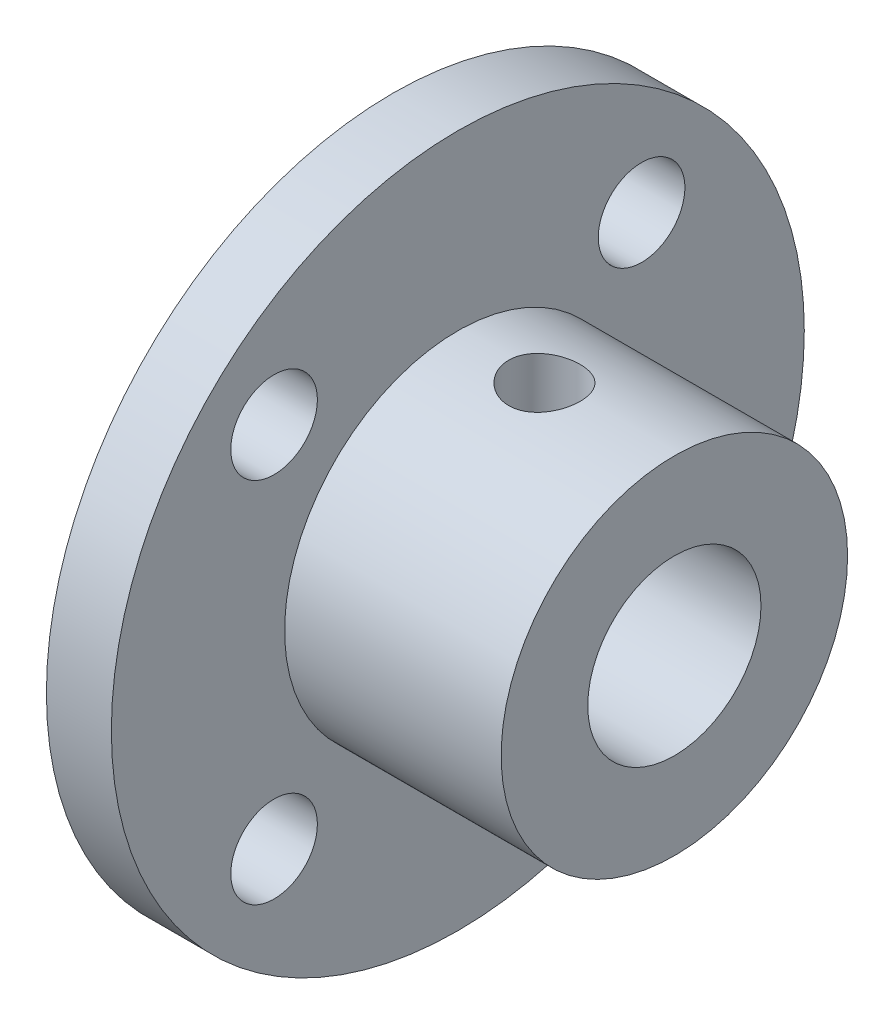
ISO-10303-21;
HEADER;
FILE_DESCRIPTION(('STEP AP214'),'2;1');
FILE_NAME('part.step','',(''),(''),'','','');
FILE_SCHEMA(('AUTOMOTIVE_DESIGN { 1 0 10303 214 1 1 1 1 }'));
ENDSEC;
DATA;
#1=APPLICATION_CONTEXT('core data for automotive mechanical design processes');
#2=APPLICATION_PROTOCOL_DEFINITION('international standard','automotive_design',2000,#1);
#3=PRODUCT_CONTEXT('',#1,'mechanical');
#4=PRODUCT('Part','Part','',(#3));
#5=PRODUCT_RELATED_PRODUCT_CATEGORY('part','',(#4));
#6=PRODUCT_DEFINITION_FORMATION('','',#4);
#7=PRODUCT_DEFINITION_CONTEXT('part definition',#1,'design');
#8=PRODUCT_DEFINITION('design','',#6,#7);
#9=PRODUCT_DEFINITION_SHAPE('','',#8);
#10=(LENGTH_UNIT() NAMED_UNIT(*) SI_UNIT(.MILLI.,.METRE.));
#11=(NAMED_UNIT(*) PLANE_ANGLE_UNIT() SI_UNIT($,.RADIAN.));
#12=(NAMED_UNIT(*) SI_UNIT($,.STERADIAN.) SOLID_ANGLE_UNIT());
#13=UNCERTAINTY_MEASURE_WITH_UNIT(LENGTH_MEASURE(1.E-05),#10,'distance_accuracy_value','');
#14=(GEOMETRIC_REPRESENTATION_CONTEXT(3) GLOBAL_UNCERTAINTY_ASSIGNED_CONTEXT((#13)) GLOBAL_UNIT_ASSIGNED_CONTEXT((#10,
#11,#12)) REPRESENTATION_CONTEXT('',''));
#15=CARTESIAN_POINT('',(0.,0.,0.));
#16=DIRECTION('',(0.,0.,1.));
#17=DIRECTION('',(1.,0.,0.));
#18=AXIS2_PLACEMENT_3D('',#15,#16,#17);
#19=CARTESIAN_POINT('',(10.,0.,0.));
#20=DIRECTION('',(1.,0.,0.));
#21=DIRECTION('',(0.,0.,-1.));
#22=AXIS2_PLACEMENT_3D('',#19,#20,#21);
#23=PLANE('',#22);
#24=CARTESIAN_POINT('',(10.,0.,0.));
#25=DIRECTION('',(1.,0.,0.));
#26=DIRECTION('',(0.,0.,-1.));
#27=AXIS2_PLACEMENT_3D('',#24,#25,#26);
#28=CIRCLE('',#27,8.);
#29=CARTESIAN_POINT('',(10.,0.,-8.));
#30=VERTEX_POINT('',#29);
#31=EDGE_CURVE('E10',#30,#30,#28,.T.);
#32=ORIENTED_EDGE('',*,*,#31,.T.);
#33=EDGE_LOOP('',(#32));
#34=FACE_BOUND('',#33,.T.);
#35=CARTESIAN_POINT('',(10.,0.,0.));
#36=DIRECTION('',(1.,0.,0.));
#37=DIRECTION('',(0.,0.,-1.));
#38=AXIS2_PLACEMENT_3D('',#35,#36,#37);
#39=CIRCLE('',#38,4.);
#40=CARTESIAN_POINT('',(10.,0.,-4.));
#41=VERTEX_POINT('',#40);
#42=EDGE_CURVE('E52',#41,#41,#39,.T.);
#43=ORIENTED_EDGE('',*,*,#42,.F.);
#44=EDGE_LOOP('',(#43));
#45=FACE_BOUND('',#44,.T.);
#46=ADVANCED_FACE('F38',(#34,#45),#23,.T.);
#47=CARTESIAN_POINT('',(10.,0.,0.));
#48=DIRECTION('',(-1.,0.,0.));
#49=DIRECTION('',(0.,0.,1.));
#50=AXIS2_PLACEMENT_3D('',#47,#48,#49);
#51=CYLINDRICAL_SURFACE('',#50,8.);
#52=CARTESIAN_POINT('',(4.00035076654487,7.82799463464303,-1.65));
#53=CARTESIAN_POINT('',(4.091968116339,7.82799647234761,-1.64999668532493));
#54=CARTESIAN_POINT('',(4.18362658129771,7.82962054015776,-1.64234339972764));
#55=CARTESIAN_POINT('',(4.36434613563069,7.83593102109728,-1.61196056082935));
#56=CARTESIAN_POINT('',(4.45340515599138,7.84061980768031,-1.58921932254548));
#57=CARTESIAN_POINT('',(4.62628525874949,7.85250661788931,-1.52939944297714));
#58=CARTESIAN_POINT('',(4.71011162215764,7.85970206178507,-1.49233553761892));
#59=CARTESIAN_POINT('',(4.87035536880974,7.8757883628587,-1.40496339378157));
#60=CARTESIAN_POINT('',(4.94677308012042,7.88467914491256,-1.35465574212316));
#61=CARTESIAN_POINT('',(5.09118206969048,7.90330366333984,-1.24141806188276));
#62=CARTESIAN_POINT('',(5.15904576782534,7.91304715328143,-1.17832691131059));
#63=CARTESIAN_POINT('',(5.28330538030519,7.93219354684102,-1.04166118718968));
#64=CARTESIAN_POINT('',(5.33970046312054,7.9415964257225,-0.968085854144705));
#65=CARTESIAN_POINT('',(5.43992019290314,7.95910768239297,-0.811692001393459));
#66=CARTESIAN_POINT('',(5.48362312036294,7.9672032148807,-0.728793920101068));
#67=CARTESIAN_POINT('',(5.5564318759791,7.98107786735649,-0.556636173632882));
#68=CARTESIAN_POINT('',(5.58553915812495,7.9868572180665,-0.467377143134519));
#69=CARTESIAN_POINT('',(5.62793187904984,7.99537941797959,-0.286356118265322));
#70=CARTESIAN_POINT('',(5.64143291864162,7.99816360714569,-0.194646593521391));
#71=CARTESIAN_POINT('',(5.6529030379666,8.00052470522147,-0.0102247919218274));
#72=CARTESIAN_POINT('',(5.65087370531701,8.00010194196704,0.0824873814688672));
#73=CARTESIAN_POINT('',(5.63150325464077,7.9961286601365,0.264799667160884));
#74=CARTESIAN_POINT('',(5.6143944216658,7.99262559257093,0.35442564460906));
#75=CARTESIAN_POINT('',(5.56571962012067,7.98293899531616,0.529506535845924));
#76=CARTESIAN_POINT('',(5.53415304765959,7.97675535366161,0.614961275239551));
#77=CARTESIAN_POINT('',(5.45724680685401,7.96232481023259,0.779930808135334));
#78=CARTESIAN_POINT('',(5.41181709665387,7.95406448397429,0.8594024031912));
#79=CARTESIAN_POINT('',(5.30854095248704,7.93638961806161,1.00967984091355));
#80=CARTESIAN_POINT('',(5.25069300384532,7.92697493766869,1.08048462481769));
#81=CARTESIAN_POINT('',(5.12295127384974,7.9078239642189,1.21279807501825));
#82=CARTESIAN_POINT('',(5.05285419053476,7.89808494418976,1.27411022634264));
#83=CARTESIAN_POINT('',(4.90327372128579,7.87954771497238,1.38414252261934));
#84=CARTESIAN_POINT('',(4.82379013459255,7.87074952591437,1.43286239817598));
#85=CARTESIAN_POINT('',(4.65739922122191,7.85508413098618,1.51640121308694));
#86=CARTESIAN_POINT('',(4.57047459099182,7.84822159457677,1.55118662114807));
#87=CARTESIAN_POINT('',(4.391839658319,7.83727167258975,1.60559987539904));
#88=CARTESIAN_POINT('',(4.30013002487229,7.83318390018328,1.62522983445703));
#89=CARTESIAN_POINT('',(4.11631420201765,7.82832430034404,1.64847767759947));
#90=CARTESIAN_POINT('',(4.02424551739551,7.82749355348184,1.65238010858406));
#91=CARTESIAN_POINT('',(3.84077289285087,7.8290836566982,1.64482933127386));
#92=CARTESIAN_POINT('',(3.74936891301321,7.83150430988348,1.63337705280605));
#93=CARTESIAN_POINT('',(3.57078784083855,7.83926913983493,1.59568777426686));
#94=CARTESIAN_POINT('',(3.48357690023534,7.84458293687796,1.56960432546509));
#95=CARTESIAN_POINT('',(3.31476300328205,7.85750843647708,1.50355797289373));
#96=CARTESIAN_POINT('',(3.23316053438895,7.8651203384623,1.46359386451765));
#97=CARTESIAN_POINT('',(3.07663931470259,7.88191579950281,1.37028211396986));
#98=CARTESIAN_POINT('',(3.0018283910492,7.89111960565472,1.31675731908659));
#99=CARTESIAN_POINT('',(2.86214624274356,7.91000699478186,1.19807829347333));
#100=CARTESIAN_POINT('',(2.79727611074392,7.91969063034348,1.13292278604281));
#101=CARTESIAN_POINT('',(2.67822982885061,7.93863877717957,0.991551131023633));
#102=CARTESIAN_POINT('',(2.62424659668679,7.94789380519354,0.915171051258591));
#103=CARTESIAN_POINT('',(2.52987848376741,7.96477402593325,0.75426073813027));
#104=CARTESIAN_POINT('',(2.48949300944358,7.97239928979603,0.669730860728582));
#105=CARTESIAN_POINT('',(2.42374396062643,7.98512048804082,0.495414150876537));
#106=CARTESIAN_POINT('',(2.39829173577687,7.99023131933467,0.405661891513272));
#107=CARTESIAN_POINT('',(2.36285201406678,7.99741186635557,0.223039444294588));
#108=CARTESIAN_POINT('',(2.35286253037978,7.99948197278732,0.130169658580923));
#109=CARTESIAN_POINT('',(2.34871283878849,8.00033781964049,-0.0542126492055723));
#110=CARTESIAN_POINT('',(2.35426325406208,7.99918360281958,-0.145718502140297));
#111=CARTESIAN_POINT('',(2.38039416163531,7.99384751004402,-0.326463478938165));
#112=CARTESIAN_POINT('',(2.40097443977329,7.98966567723011,-0.415702635080896));
#113=CARTESIAN_POINT('',(2.45644890770306,7.97874682116246,-0.589186560182794));
#114=CARTESIAN_POINT('',(2.49130627753187,7.97201637401338,-0.673443542985805));
#115=CARTESIAN_POINT('',(2.57430780865125,7.95672300876336,-0.83495351327695));
#116=CARTESIAN_POINT('',(2.62245310011739,7.9481599348062,-0.912205904261777));
#117=CARTESIAN_POINT('',(2.73162941183047,7.92995681960445,-1.05893847166514));
#118=CARTESIAN_POINT('',(2.7928663362949,7.92030089151862,-1.12826349060999));
#119=CARTESIAN_POINT('',(2.92606700819132,7.90109178015231,-1.25575285452553));
#120=CARTESIAN_POINT('',(2.99803330509024,7.89153862187156,-1.31391453937944));
#121=CARTESIAN_POINT('',(3.15165187037277,7.87349423401939,-1.41807001635073));
#122=CARTESIAN_POINT('',(3.23340676885327,7.86501660134749,-1.46391490783104));
#123=CARTESIAN_POINT('',(3.40361365271401,7.85025069483304,-1.54114313624576));
#124=CARTESIAN_POINT('',(3.49205961211167,7.84396047891661,-1.5725393093673));
#125=CARTESIAN_POINT('',(3.65061799084718,7.83550744278865,-1.61404620798977));
#126=CARTESIAN_POINT('',(3.7198397149459,7.83270799535493,-1.62750420424828));
#127=CARTESIAN_POINT('',(3.85948314308952,7.82895092043294,-1.64548220150439));
#128=CARTESIAN_POINT('',(3.92990480054815,7.82799322160417,-1.65000254870379));
#129=CARTESIAN_POINT('',(4.00035076654487,7.82799463464303,-1.65));
#130=B_SPLINE_CURVE_WITH_KNOTS('',3,(#52,#53,#54,#55,#56,#57,#58,#59,#60,#61,#62,#63,#64,#65,
#66,#67,#68,#69,#70,#71,#72,#73,#74,#75,#76,#77,#78,#79,#80,#81,#82,#83,#84,#85,#86,#87,#88,#89,
#90,#91,#92,#93,#94,#95,#96,#97,#98,#99,#100,#101,#102,#103,#104,#105,#106,#107,#108,#109,#110,
#111,#112,#113,#114,#115,#116,#117,#118,#119,#120,#121,#122,#123,#124,#125,#126,#127,#128,#129),
.UNSPECIFIED.,.T.,.F.,(4,2,2,2,2,2,2,2,2,2,2,2,2,2,2,2,2,2,2,2,2,2,2,2,2,2,2,2,2,2,2,2,2,2,2,2,
2,2,4),(0.,0.274594036981749,0.549400984088786,0.823925944657622,1.09843874327276,
1.3766547467594,1.65489091505464,1.93571338943598,2.21650788327397,2.49337499570618,
2.7702138053317,3.04286128513494,3.31552015429504,3.58998907522696,3.86449149267073,
4.14407920367274,4.42367289560191,4.70393540521658,4.98415883550651,5.25928898855094,
5.53440248143717,5.80668132243982,6.07898379854719,6.3550456167432,6.63113775683412,
6.91175972338567,7.19236943866021,7.47129602001296,7.75018675877317,8.02391884651824,
8.29764703391015,8.57067368982021,8.8437235745846,9.12143378060413,9.3992100804003,
9.68020708192082,9.96095396255221,10.1721016499172,10.38324115827),.UNSPECIFIED.);
#131=CARTESIAN_POINT('',(4.00035076654487,7.82799463464303,-1.65));
#132=VERTEX_POINT('',#131);
#133=EDGE_CURVE('E96',#132,#132,#130,.T.);
#134=ORIENTED_EDGE('',*,*,#133,.T.);
#135=EDGE_LOOP('',(#134));
#136=FACE_BOUND('',#135,.T.);
#137=ORIENTED_EDGE('',*,*,#31,.F.);
#138=EDGE_LOOP('',(#137));
#139=FACE_BOUND('',#138,.T.);
#140=CARTESIAN_POINT('',(0.,0.,0.));
#141=DIRECTION('',(1.,0.,0.));
#142=DIRECTION('',(0.,0.,-1.));
#143=AXIS2_PLACEMENT_3D('',#140,#141,#142);
#144=CIRCLE('',#143,8.);
#145=CARTESIAN_POINT('',(0.,0.,-8.));
#146=VERTEX_POINT('',#145);
#147=EDGE_CURVE('E57',#146,#146,#144,.T.);
#148=ORIENTED_EDGE('',*,*,#147,.T.);
#149=EDGE_LOOP('',(#148));
#150=FACE_BOUND('',#149,.T.);
#151=ADVANCED_FACE('F40',(#136,#139,#150),#51,.T.);
#152=CARTESIAN_POINT('',(10.,0.,0.));
#153=DIRECTION('',(-1.,0.,0.));
#154=DIRECTION('',(0.,0.,1.));
#155=AXIS2_PLACEMENT_3D('',#152,#153,#154);
#156=CYLINDRICAL_SURFACE('',#155,4.);
#157=CARTESIAN_POINT('',(4.00035076654487,3.64383040220041,-1.65));
#158=CARTESIAN_POINT('',(4.08844724677055,3.64383945275153,-1.64999056813102));
#159=CARTESIAN_POINT('',(4.17669119851846,3.64707173267573,-1.64289989177358));
#160=CARTESIAN_POINT('',(4.35063782762375,3.65959209124688,-1.61480845546373));
#161=CARTESIAN_POINT('',(4.43633286714247,3.66889676295874,-1.5937695789634));
#162=CARTESIAN_POINT('',(4.6023537046755,3.69231325052126,-1.53873536249638));
#163=CARTESIAN_POINT('',(4.68269958676346,3.70640571161012,-1.50479212400174));
#164=CARTESIAN_POINT('',(4.83653253337909,3.73778230052357,-1.42506535594206));
#165=CARTESIAN_POINT('',(4.9100213093289,3.75506562873473,-1.37928479159595));
#166=CARTESIAN_POINT('',(5.05257945439137,3.7920553041855,-1.27419856290371));
#167=CARTESIAN_POINT('',(5.12118002232507,3.81184277704779,-1.2142851824136));
#168=CARTESIAN_POINT('',(5.24770553845363,3.85094363418238,-1.08391072165483));
#169=CARTESIAN_POINT('',(5.30562641801709,3.87025683535296,-1.01344563996364));
#170=CARTESIAN_POINT('',(5.41152213784673,3.90721575035942,-0.860301943593381));
#171=CARTESIAN_POINT('',(5.45897169925103,3.92475616703248,-0.77723239011359));
#172=CARTESIAN_POINT('',(5.53902091186657,3.95520283117798,-0.603436361875856));
#173=CARTESIAN_POINT('',(5.57162703089143,3.96811109652272,-0.512713242513044));
#174=CARTESIAN_POINT('',(5.61937147320109,3.98726403378776,-0.331105172304397));
#175=CARTESIAN_POINT('',(5.6353176144681,3.99381564337609,-0.240465625184492));
#176=CARTESIAN_POINT('',(5.65189741840004,4.0006306156112,-0.0575763551498648));
#177=CARTESIAN_POINT('',(5.65253716186688,4.00089647540932,0.0346727137709554));
#178=CARTESIAN_POINT('',(5.63891427040827,3.99529224160632,0.212297380895985));
#179=CARTESIAN_POINT('',(5.62553858282777,3.98978733384658,0.297754665400397));
#180=CARTESIAN_POINT('',(5.58578194909711,3.97375926025944,0.465085845235279));
#181=CARTESIAN_POINT('',(5.55940004525419,3.96323572489496,0.546959476205492));
#182=CARTESIAN_POINT('',(5.49406310482469,3.93798907731603,0.706295606817229));
#183=CARTESIAN_POINT('',(5.45492277662,3.92320447216362,0.78367197976247));
#184=CARTESIAN_POINT('',(5.36535948735826,3.89088763760773,0.930960489992467));
#185=CARTESIAN_POINT('',(5.31493256604156,3.87335444442336,1.00086999453932));
#186=CARTESIAN_POINT('',(5.20016252751623,3.83587133640027,1.13638530947041));
#187=CARTESIAN_POINT('',(5.13509735564614,3.8158381454309,1.20135746318645));
#188=CARTESIAN_POINT('',(4.99494110022329,3.77653142784555,1.31973838423493));
#189=CARTESIAN_POINT('',(4.91984631728157,3.75725818494773,1.37314286572202));
#190=CARTESIAN_POINT('',(4.75875236299755,3.72106607156909,1.46845339844828));
#191=CARTESIAN_POINT('',(4.67248319485222,3.70424107982558,1.50994179309277));
#192=CARTESIAN_POINT('',(4.49330409513897,3.67596385006485,1.57754508127095));
#193=CARTESIAN_POINT('',(4.40039885267105,3.66450786071418,1.60367071206121));
#194=CARTESIAN_POINT('',(4.21692787135988,3.64919091711418,1.63821320355941));
#195=CARTESIAN_POINT('',(4.12659246536201,3.64489111171831,1.64765569454682));
#196=CARTESIAN_POINT('',(3.94554513684627,3.64311980380967,1.65157101672826));
#197=CARTESIAN_POINT('',(3.85483335048559,3.64564601607449,1.64604885780402));
#198=CARTESIAN_POINT('',(3.6815497574954,3.65678944366161,1.62112710501826));
#199=CARTESIAN_POINT('',(3.59882258687026,3.66501803861665,1.60261202118543));
#200=CARTESIAN_POINT('',(3.4377137021649,3.68614612916707,1.55339580262015));
#201=CARTESIAN_POINT('',(3.35933299519321,3.69904670212356,1.52269185697123));
#202=CARTESIAN_POINT('',(3.20547176084923,3.72872477858182,1.44853902204985));
#203=CARTESIAN_POINT('',(3.13025057176562,3.74564214050945,1.40460979308264));
#204=CARTESIAN_POINT('',(2.98789059711513,3.78124523189864,1.30573455409451));
#205=CARTESIAN_POINT('',(2.92075527880975,3.79993171387674,1.25078384473683));
#206=CARTESIAN_POINT('',(2.79092114009815,3.83876011670653,1.12627542162098));
#207=CARTESIAN_POINT('',(2.72899902949615,3.85889967217623,1.05590387126704));
#208=CARTESIAN_POINT('',(2.6177079108828,3.89698114804694,0.905297980080102));
#209=CARTESIAN_POINT('',(2.56833971454167,3.91492292631236,0.825063002026903));
#210=CARTESIAN_POINT('',(2.48364663233808,3.94668767391886,0.656516816883267));
#211=CARTESIAN_POINT('',(2.44834729154214,3.96050313975064,0.568191273870491));
#212=CARTESIAN_POINT('',(2.39335910968612,3.98237104121022,0.386140833605177));
#213=CARTESIAN_POINT('',(2.37366118360593,3.9904268305481,0.29241911281756));
#214=CARTESIAN_POINT('',(2.35156253762439,3.9994889299446,0.109187189544836));
#215=CARTESIAN_POINT('',(2.34806593780293,4.00094173424749,0.0198303081186357));
#216=CARTESIAN_POINT('',(2.35553620091515,3.99786220239438,-0.158161739195411));
#217=CARTESIAN_POINT('',(2.36650061654032,3.99333087896147,-0.246797024648479));
#218=CARTESIAN_POINT('',(2.40179540868043,3.979024148364,-0.417705375935876));
#219=CARTESIAN_POINT('',(2.42565520865942,3.96943363922013,-0.500092371627851));
#220=CARTESIAN_POINT('',(2.48555488142486,3.94605480923816,-0.659667355734159));
#221=CARTESIAN_POINT('',(2.52159709133155,3.93226568297163,-0.736854343148743));
#222=CARTESIAN_POINT('',(2.60665529323126,3.90105808483759,-0.887661133732618));
#223=CARTESIAN_POINT('',(2.6561820233178,3.88350423911689,-0.960964214361148));
#224=CARTESIAN_POINT('',(2.76605361333487,3.84685709666619,-1.09852932170704));
#225=CARTESIAN_POINT('',(2.82640238962568,3.82776324400832,-1.1627880603165));
#226=CARTESIAN_POINT('',(2.96093829389953,3.78859741195738,-1.28487769945047));
#227=CARTESIAN_POINT('',(3.03577852342981,3.76854475207571,-1.34199767947157));
#228=CARTESIAN_POINT('',(3.19461674222593,3.73105419200534,-1.4429647467733));
#229=CARTESIAN_POINT('',(3.27861975825446,3.7136177396712,-1.48680449811903));
#230=CARTESIAN_POINT('',(3.45307920781476,3.68370387904713,-1.55944447766651));
#231=CARTESIAN_POINT('',(3.54348987463596,3.67119480418034,-1.58834112875234));
#232=CARTESIAN_POINT('',(3.72839791062323,3.65281837075147,-1.63017263567573));
#233=CARTESIAN_POINT('',(3.82288045742174,3.64692873900432,-1.64316103312974));
#234=CARTESIAN_POINT('',(3.94521408018751,3.64414054419779,-1.6493120932942));
#235=CARTESIAN_POINT('',(3.97277519882989,3.64382756923723,-1.6500029523216));
#236=CARTESIAN_POINT('',(4.00035076654487,3.64383040220041,-1.65));
#237=B_SPLINE_CURVE_WITH_KNOTS('',3,(#157,#158,#159,#160,#161,#162,#163,#164,#165,#166,#167,
#168,#169,#170,#171,#172,#173,#174,#175,#176,#177,#178,#179,#180,#181,#182,#183,#184,#185,#186,
#187,#188,#189,#190,#191,#192,#193,#194,#195,#196,#197,#198,#199,#200,#201,#202,#203,#204,#205,
#206,#207,#208,#209,#210,#211,#212,#213,#214,#215,#216,#217,#218,#219,#220,#221,#222,#223,#224,
#225,#226,#227,#228,#229,#230,#231,#232,#233,#234,#235,#236),.UNSPECIFIED.,.T.,.F.,(4,2,2,2,2,2,
2,2,2,2,2,2,2,2,2,2,2,2,2,2,2,2,2,2,2,2,2,2,2,2,2,2,2,2,2,2,2,2,2,4),(0.,0.264211724660745,
0.529148459018597,0.793026677872048,1.05683885985756,1.33523297260792,1.61373292676209,
1.90403076094908,2.19420198072699,2.46953816244269,2.74476495901023,3.00356896819765,
3.26239203686791,3.52515526924739,3.78801084539545,4.06907613148064,4.35024537535724,
4.64031806272423,4.9301877724111,5.20152035698263,5.47276211576042,5.72713321026165,
5.9815630002888,6.24665916965708,6.51186861189123,6.79815687284346,7.08446363898862,
7.3712879145617,7.6579450434915,7.92489841526078,8.19180661499934,8.44957452423758,
8.70739191275387,8.97680852354694,9.24632283025306,9.53374725602174,9.82133016535515,
10.1070334851925,10.3917725616094,10.4744749384331),.UNSPECIFIED.);
#238=CARTESIAN_POINT('',(4.00035076654487,3.64383040220041,-1.65));
#239=VERTEX_POINT('',#238);
#240=EDGE_CURVE('E43',#239,#239,#237,.T.);
#241=ORIENTED_EDGE('',*,*,#240,.F.);
#242=EDGE_LOOP('',(#241));
#243=FACE_BOUND('',#242,.T.);
#244=ORIENTED_EDGE('',*,*,#42,.T.);
#245=EDGE_LOOP('',(#244));
#246=FACE_BOUND('',#245,.T.);
#247=CARTESIAN_POINT('',(-3.,0.,0.));
#248=DIRECTION('',(-1.,0.,0.));
#249=DIRECTION('',(0.,0.,1.));
#250=AXIS2_PLACEMENT_3D('',#247,#248,#249);
#251=CIRCLE('',#250,4.);
#252=CARTESIAN_POINT('',(-3.,0.,4.));
#253=VERTEX_POINT('',#252);
#254=EDGE_CURVE('E70',#253,#253,#251,.T.);
#255=ORIENTED_EDGE('',*,*,#254,.T.);
#256=EDGE_LOOP('',(#255));
#257=FACE_BOUND('',#256,.T.);
#258=ADVANCED_FACE('F130',(#243,#246,#257),#156,.F.);
#259=CARTESIAN_POINT('',(-3.,0.,0.));
#260=DIRECTION('',(-1.,0.,0.));
#261=DIRECTION('',(0.,0.,1.));
#262=AXIS2_PLACEMENT_3D('',#259,#260,#261);
#263=PLANE('',#262);
#264=CARTESIAN_POINT('',(-3.,-8.48528137423853,-8.48528137423862));
#265=DIRECTION('',(-1.,0.,0.));
#266=DIRECTION('',(0.,0.,1.));
#267=AXIS2_PLACEMENT_3D('',#264,#265,#266);
#268=CIRCLE('',#267,2.);
#269=CARTESIAN_POINT('',(-3.,-8.48528137423853,-6.48528137423862));
#270=VERTEX_POINT('',#269);
#271=EDGE_CURVE('E88',#270,#270,#268,.F.);
#272=ORIENTED_EDGE('',*,*,#271,.T.);
#273=EDGE_LOOP('',(#272));
#274=FACE_BOUND('',#273,.T.);
#275=CARTESIAN_POINT('',(-3.,8.48528137423858,8.48528137423856));
#276=DIRECTION('',(-1.,0.,0.));
#277=DIRECTION('',(0.,0.,1.));
#278=AXIS2_PLACEMENT_3D('',#275,#276,#277);
#279=CIRCLE('',#278,2.);
#280=CARTESIAN_POINT('',(-3.,8.48528137423858,10.4852813742386));
#281=VERTEX_POINT('',#280);
#282=EDGE_CURVE('E81',#281,#281,#279,.F.);
#283=ORIENTED_EDGE('',*,*,#282,.T.);
#284=EDGE_LOOP('',(#283));
#285=FACE_BOUND('',#284,.T.);
#286=CARTESIAN_POINT('',(-3.,8.48528137423853,-8.48528137423862));
#287=DIRECTION('',(-1.,0.,0.));
#288=DIRECTION('',(0.,0.,1.));
#289=AXIS2_PLACEMENT_3D('',#286,#287,#288);
#290=CIRCLE('',#289,2.);
#291=CARTESIAN_POINT('',(-3.,8.48528137423853,-6.48528137423862));
#292=VERTEX_POINT('',#291);
#293=EDGE_CURVE('E93',#292,#292,#290,.F.);
#294=ORIENTED_EDGE('',*,*,#293,.T.);
#295=EDGE_LOOP('',(#294));
#296=FACE_BOUND('',#295,.T.);
#297=CARTESIAN_POINT('',(-3.,-8.4852813742386,8.48528137423854));
#298=DIRECTION('',(-1.,0.,0.));
#299=DIRECTION('',(0.,0.,1.));
#300=AXIS2_PLACEMENT_3D('',#297,#298,#299);
#301=CIRCLE('',#300,2.);
#302=CARTESIAN_POINT('',(-3.,-8.4852813742386,10.4852813742385));
#303=VERTEX_POINT('',#302);
#304=EDGE_CURVE('E75',#303,#303,#301,.F.);
#305=ORIENTED_EDGE('',*,*,#304,.T.);
#306=EDGE_LOOP('',(#305));
#307=FACE_BOUND('',#306,.T.);
#308=CARTESIAN_POINT('',(-3.,0.,0.));
#309=DIRECTION('',(-1.,0.,0.));
#310=DIRECTION('',(0.,0.,1.));
#311=AXIS2_PLACEMENT_3D('',#308,#309,#310);
#312=CIRCLE('',#311,16.);
#313=CARTESIAN_POINT('',(-3.,0.,16.));
#314=VERTEX_POINT('',#313);
#315=EDGE_CURVE('E61',#314,#314,#312,.T.);
#316=ORIENTED_EDGE('',*,*,#315,.T.);
#317=EDGE_LOOP('',(#316));
#318=FACE_BOUND('',#317,.T.);
#319=ORIENTED_EDGE('',*,*,#254,.F.);
#320=EDGE_LOOP('',(#319));
#321=FACE_BOUND('',#320,.T.);
#322=ADVANCED_FACE('F126',(#274,#285,#296,#307,#318,#321),#263,.T.);
#323=CARTESIAN_POINT('',(0.,0.,0.));
#324=DIRECTION('',(-1.,0.,0.));
#325=DIRECTION('',(0.,0.,1.));
#326=AXIS2_PLACEMENT_3D('',#323,#324,#325);
#327=PLANE('',#326);
#328=CARTESIAN_POINT('',(0.,-8.48528137423853,-8.48528137423862));
#329=DIRECTION('',(1.,0.,0.));
#330=DIRECTION('',(0.,0.,1.));
#331=AXIS2_PLACEMENT_3D('',#328,#329,#330);
#332=CIRCLE('',#331,2.);
#333=CARTESIAN_POINT('',(0.,-8.48528137423853,-6.48528137423862));
#334=VERTEX_POINT('',#333);
#335=EDGE_CURVE('E78',#334,#334,#332,.T.);
#336=ORIENTED_EDGE('',*,*,#335,.F.);
#337=EDGE_LOOP('',(#336));
#338=FACE_BOUND('',#337,.T.);
#339=CARTESIAN_POINT('',(0.,8.48528137423858,8.48528137423856));
#340=DIRECTION('',(1.,0.,0.));
#341=DIRECTION('',(0.,0.,-1.));
#342=AXIS2_PLACEMENT_3D('',#339,#340,#341);
#343=CIRCLE('',#342,2.);
#344=CARTESIAN_POINT('',(0.,8.48528137423858,6.48528137423856));
#345=VERTEX_POINT('',#344);
#346=EDGE_CURVE('E84',#345,#345,#343,.T.);
#347=ORIENTED_EDGE('',*,*,#346,.F.);
#348=EDGE_LOOP('',(#347));
#349=FACE_BOUND('',#348,.T.);
#350=CARTESIAN_POINT('',(0.,8.48528137423853,-8.48528137423862));
#351=DIRECTION('',(1.,0.,0.));
#352=DIRECTION('',(0.,0.,1.));
#353=AXIS2_PLACEMENT_3D('',#350,#351,#352);
#354=CIRCLE('',#353,2.);
#355=CARTESIAN_POINT('',(0.,8.48528137423853,-6.48528137423862));
#356=VERTEX_POINT('',#355);
#357=EDGE_CURVE('E85',#356,#356,#354,.T.);
#358=ORIENTED_EDGE('',*,*,#357,.F.);
#359=EDGE_LOOP('',(#358));
#360=FACE_BOUND('',#359,.T.);
#361=CARTESIAN_POINT('',(0.,-8.4852813742386,8.48528137423854));
#362=DIRECTION('',(1.,0.,0.));
#363=DIRECTION('',(0.,0.,-1.));
#364=AXIS2_PLACEMENT_3D('',#361,#362,#363);
#365=CIRCLE('',#364,2.);
#366=CARTESIAN_POINT('',(0.,-8.4852813742386,6.48528137423854));
#367=VERTEX_POINT('',#366);
#368=EDGE_CURVE('E74',#367,#367,#365,.T.);
#369=ORIENTED_EDGE('',*,*,#368,.F.);
#370=EDGE_LOOP('',(#369));
#371=FACE_BOUND('',#370,.T.);
#372=ORIENTED_EDGE('',*,*,#147,.F.);
#373=EDGE_LOOP('',(#372));
#374=FACE_BOUND('',#373,.T.);
#375=CARTESIAN_POINT('',(0.,0.,0.));
#376=DIRECTION('',(-1.,0.,0.));
#377=DIRECTION('',(0.,0.,1.));
#378=AXIS2_PLACEMENT_3D('',#375,#376,#377);
#379=CIRCLE('',#378,16.);
#380=CARTESIAN_POINT('',(0.,0.,16.));
#381=VERTEX_POINT('',#380);
#382=EDGE_CURVE('E65',#381,#381,#379,.T.);
#383=ORIENTED_EDGE('',*,*,#382,.F.);
#384=EDGE_LOOP('',(#383));
#385=FACE_BOUND('',#384,.T.);
#386=ADVANCED_FACE('F129',(#338,#349,#360,#371,#374,#385),#327,.F.);
#387=CARTESIAN_POINT('',(-3.,0.,0.));
#388=DIRECTION('',(1.,0.,0.));
#389=DIRECTION('',(0.,0.,-1.));
#390=AXIS2_PLACEMENT_3D('',#387,#388,#389);
#391=CYLINDRICAL_SURFACE('',#390,16.);
#392=ORIENTED_EDGE('',*,*,#315,.F.);
#393=EDGE_LOOP('',(#392));
#394=FACE_BOUND('',#393,.T.);
#395=ORIENTED_EDGE('',*,*,#382,.T.);
#396=EDGE_LOOP('',(#395));
#397=FACE_BOUND('',#396,.T.);
#398=ADVANCED_FACE('F124',(#394,#397),#391,.T.);
#399=CARTESIAN_POINT('',(-3.001,-8.4852813742386,8.48528137423854));
#400=DIRECTION('',(1.,0.,0.));
#401=DIRECTION('',(0.,0.,-1.));
#402=AXIS2_PLACEMENT_3D('',#399,#400,#401);
#403=CYLINDRICAL_SURFACE('',#402,2.);
#404=ORIENTED_EDGE('',*,*,#304,.F.);
#405=EDGE_LOOP('',(#404));
#406=FACE_BOUND('',#405,.T.);
#407=ORIENTED_EDGE('',*,*,#368,.T.);
#408=EDGE_LOOP('',(#407));
#409=FACE_BOUND('',#408,.T.);
#410=ADVANCED_FACE('F114',(#406,#409),#403,.F.);
#411=CARTESIAN_POINT('',(-3.001,8.48528137423853,-8.48528137423862));
#412=DIRECTION('',(1.,0.,0.));
#413=DIRECTION('',(0.,0.,-1.));
#414=AXIS2_PLACEMENT_3D('',#411,#412,#413);
#415=CYLINDRICAL_SURFACE('',#414,2.);
#416=ORIENTED_EDGE('',*,*,#293,.F.);
#417=EDGE_LOOP('',(#416));
#418=FACE_BOUND('',#417,.T.);
#419=ORIENTED_EDGE('',*,*,#357,.T.);
#420=EDGE_LOOP('',(#419));
#421=FACE_BOUND('',#420,.T.);
#422=ADVANCED_FACE('F109',(#418,#421),#415,.F.);
#423=CARTESIAN_POINT('',(-3.001,8.48528137423858,8.48528137423856));
#424=DIRECTION('',(1.,0.,0.));
#425=DIRECTION('',(0.,0.,-1.));
#426=AXIS2_PLACEMENT_3D('',#423,#424,#425);
#427=CYLINDRICAL_SURFACE('',#426,2.);
#428=ORIENTED_EDGE('',*,*,#282,.F.);
#429=EDGE_LOOP('',(#428));
#430=FACE_BOUND('',#429,.T.);
#431=ORIENTED_EDGE('',*,*,#346,.T.);
#432=EDGE_LOOP('',(#431));
#433=FACE_BOUND('',#432,.T.);
#434=ADVANCED_FACE('F113',(#430,#433),#427,.F.);
#435=CARTESIAN_POINT('',(-3.001,-8.48528137423853,-8.48528137423862));
#436=DIRECTION('',(1.,0.,0.));
#437=DIRECTION('',(0.,0.,-1.));
#438=AXIS2_PLACEMENT_3D('',#435,#436,#437);
#439=CYLINDRICAL_SURFACE('',#438,2.);
#440=ORIENTED_EDGE('',*,*,#271,.F.);
#441=EDGE_LOOP('',(#440));
#442=FACE_BOUND('',#441,.T.);
#443=ORIENTED_EDGE('',*,*,#335,.T.);
#444=EDGE_LOOP('',(#443));
#445=FACE_BOUND('',#444,.T.);
#446=ADVANCED_FACE('F107',(#442,#445),#439,.F.);
#447=CARTESIAN_POINT('',(4.00035076654487,0.,0.));
#448=DIRECTION('',(0.,-1.,0.));
#449=DIRECTION('',(0.,0.,-1.));
#450=AXIS2_PLACEMENT_3D('',#447,#448,#449);
#451=CYLINDRICAL_SURFACE('',#450,1.65);
#452=ORIENTED_EDGE('',*,*,#240,.T.);
#453=EDGE_LOOP('',(#452));
#454=FACE_BOUND('',#453,.T.);
#455=ORIENTED_EDGE('',*,*,#133,.F.);
#456=EDGE_LOOP('',(#455));
#457=FACE_BOUND('',#456,.T.);
#458=ADVANCED_FACE('F103',(#454,#457),#451,.F.);
#459=CLOSED_SHELL('',(#46,#151,#258,#322,#386,#398,#410,#422,#434,#446,#458));
#460=MANIFOLD_SOLID_BREP('B2',#459);
#461=ADVANCED_BREP_SHAPE_REPRESENTATION('',(#18,#460),#14);
#462=SHAPE_DEFINITION_REPRESENTATION(#9,#461);
ENDSEC;
END-ISO-10303-21;
